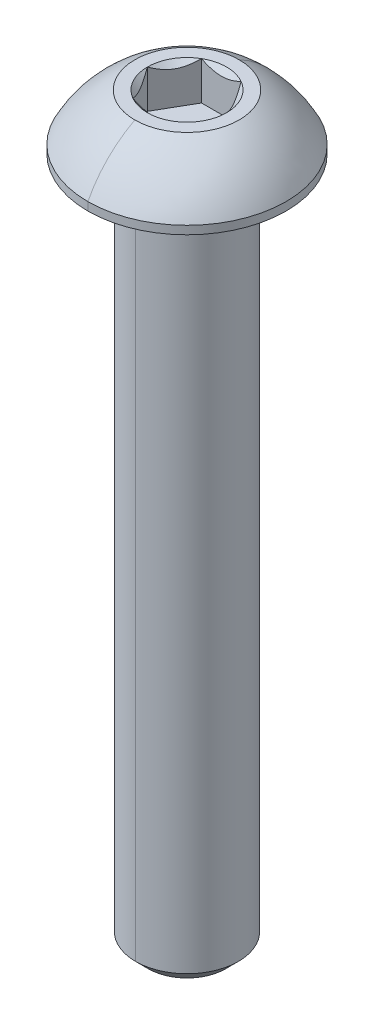
ISO-10303-21;
HEADER;
FILE_DESCRIPTION(('STEP AP214'),'2;1');
FILE_NAME('part.step','',(''),(''),'','','');
FILE_SCHEMA(('AUTOMOTIVE_DESIGN { 1 0 10303 214 1 1 1 1 }'));
ENDSEC;
DATA;
#1=APPLICATION_CONTEXT('core data for automotive mechanical design processes');
#2=APPLICATION_PROTOCOL_DEFINITION('international standard','automotive_design',2000,#1);
#3=PRODUCT_CONTEXT('',#1,'mechanical');
#4=PRODUCT('Part','Part','',(#3));
#5=PRODUCT_RELATED_PRODUCT_CATEGORY('part','',(#4));
#6=PRODUCT_DEFINITION_FORMATION('','',#4);
#7=PRODUCT_DEFINITION_CONTEXT('part definition',#1,'design');
#8=PRODUCT_DEFINITION('design','',#6,#7);
#9=PRODUCT_DEFINITION_SHAPE('','',#8);
#10=(LENGTH_UNIT() NAMED_UNIT(*) SI_UNIT(.MILLI.,.METRE.));
#11=(NAMED_UNIT(*) PLANE_ANGLE_UNIT() SI_UNIT($,.RADIAN.));
#12=(NAMED_UNIT(*) SI_UNIT($,.STERADIAN.) SOLID_ANGLE_UNIT());
#13=UNCERTAINTY_MEASURE_WITH_UNIT(LENGTH_MEASURE(1.E-05),#10,'distance_accuracy_value','');
#14=(GEOMETRIC_REPRESENTATION_CONTEXT(3) GLOBAL_UNCERTAINTY_ASSIGNED_CONTEXT((#13)) GLOBAL_UNIT_ASSIGNED_CONTEXT((#10,
#11,#12)) REPRESENTATION_CONTEXT('',''));
#15=CARTESIAN_POINT('',(0.,0.,0.));
#16=DIRECTION('',(0.,0.,1.));
#17=DIRECTION('',(1.,0.,0.));
#18=AXIS2_PLACEMENT_3D('',#15,#16,#17);
#19=CARTESIAN_POINT('',(0.,-0.152399999999997,0.));
#20=DIRECTION('',(0.,1.,0.));
#21=DIRECTION('',(0.,0.,1.));
#22=AXIS2_PLACEMENT_3D('',#19,#20,#21);
#23=TOROIDAL_SURFACE('',#22,2.5273,0.1524);
#24=CARTESIAN_POINT('',(0.,-0.152399999999997,-2.5273));
#25=DIRECTION('',(1.,0.,0.));
#26=DIRECTION('',(0.,0.,-1.));
#27=AXIS2_PLACEMENT_3D('',#24,#25,#26);
#28=CIRCLE('',#27,0.1524);
#29=CARTESIAN_POINT('',(0.,0.,-2.5273));
#30=VERTEX_POINT('',#29);
#31=CARTESIAN_POINT('',(0.,-0.152399999999997,-2.3749));
#32=VERTEX_POINT('',#31);
#33=EDGE_CURVE('E201',#30,#32,#28,.T.);
#34=ORIENTED_EDGE('',*,*,#33,.F.);
#35=CARTESIAN_POINT('',(0.,0.,0.));
#36=DIRECTION('',(0.,1.,0.));
#37=DIRECTION('',(0.,0.,1.));
#38=AXIS2_PLACEMENT_3D('',#35,#36,#37);
#39=CIRCLE('',#38,2.5273);
#40=CARTESIAN_POINT('',(0.,0.,2.5273));
#41=VERTEX_POINT('',#40);
#42=EDGE_CURVE('E188',#41,#30,#39,.T.);
#43=ORIENTED_EDGE('',*,*,#42,.F.);
#44=CARTESIAN_POINT('',(0.,-0.152399999999997,2.5273));
#45=DIRECTION('',(-1.,0.,0.));
#46=DIRECTION('',(0.,0.,1.));
#47=AXIS2_PLACEMENT_3D('',#44,#45,#46);
#48=CIRCLE('',#47,0.1524);
#49=CARTESIAN_POINT('',(0.,-0.152399999999997,2.3749));
#50=VERTEX_POINT('',#49);
#51=EDGE_CURVE('E211',#41,#50,#48,.T.);
#52=ORIENTED_EDGE('',*,*,#51,.T.);
#53=CARTESIAN_POINT('',(0.,-0.152399999999997,0.));
#54=DIRECTION('',(0.,-1.,0.));
#55=DIRECTION('',(0.,0.,1.));
#56=AXIS2_PLACEMENT_3D('',#53,#54,#55);
#57=CIRCLE('',#56,2.3749);
#58=EDGE_CURVE('E203',#32,#50,#57,.T.);
#59=ORIENTED_EDGE('',*,*,#58,.F.);
#60=EDGE_LOOP('',(#34,#43,#52,#59));
#61=FACE_BOUND('',#60,.T.);
#62=ADVANCED_FACE('F16',(#61),#23,.F.);
#63=CARTESIAN_POINT('',(0.,2.5654,0.));
#64=DIRECTION('',(0.,1.,0.));
#65=DIRECTION('',(0.,0.,1.));
#66=AXIS2_PLACEMENT_3D('',#63,#64,#65);
#67=CONICAL_SURFACE('',#66,1.83308710467706,0.78539816339745);
#68=DIRECTION('',(0.,0.707106781186546,-0.707106781186549));
#69=VECTOR('',#68,1.);
#70=CARTESIAN_POINT('',(0.,2.5654,-1.83308710467706));
#71=LINE('',#70,#69);
#72=CARTESIAN_POINT('',(0.,0.732312895322944,0.));
#73=VERTEX_POINT('',#72);
#74=CARTESIAN_POINT('',(0.,0.7874,-0.0550871046770556));
#75=VERTEX_POINT('',#74);
#76=EDGE_CURVE('E179',#73,#75,#71,.T.);
#77=ORIENTED_EDGE('',*,*,#76,.F.);
#78=DIRECTION('',(0.,0.707106781186546,0.707106781186549));
#79=VECTOR('',#78,1.);
#80=CARTESIAN_POINT('',(0.,2.5654,1.83308710467706));
#81=LINE('',#80,#79);
#82=CARTESIAN_POINT('',(0.,0.7874,0.0550871046770556));
#83=VERTEX_POINT('',#82);
#84=EDGE_CURVE('E228',#73,#83,#81,.T.);
#85=ORIENTED_EDGE('',*,*,#84,.T.);
#86=CARTESIAN_POINT('',(0.,0.7874,0.));
#87=DIRECTION('',(0.,1.,0.));
#88=DIRECTION('',(0.,0.,1.));
#89=AXIS2_PLACEMENT_3D('',#86,#87,#88);
#90=CIRCLE('',#89,0.0550871046770558);
#91=EDGE_CURVE('E169',#83,#75,#90,.T.);
#92=ORIENTED_EDGE('',*,*,#91,.T.);
#93=EDGE_LOOP('',(#77,#85,#92));
#94=FACE_BOUND('',#93,.T.);
#95=ADVANCED_FACE('F321',(#94),#67,.F.);
#96=CARTESIAN_POINT('',(1.83308710467706,0.7874,0.));
#97=DIRECTION('',(0.866025403784439,0.,-0.5));
#98=DIRECTION('',(0.,-1.,0.));
#99=AXIS2_PLACEMENT_3D('',#96,#97,#98);
#100=PLANE('',#99);
#101=DIRECTION('',(0.,1.,0.));
#102=VECTOR('',#101,1.);
#103=CARTESIAN_POINT('',(1.83308710467706,0.7874,0.));
#104=LINE('',#103,#102);
#105=CARTESIAN_POINT('',(1.83308710467706,0.7874,0.));
#106=VERTEX_POINT('',#105);
#107=CARTESIAN_POINT('',(1.83308710467706,2.5654,0.));
#108=VERTEX_POINT('',#107);
#109=EDGE_CURVE('E11',#106,#108,#104,.T.);
#110=ORIENTED_EDGE('',*,*,#109,.T.);
#111=CARTESIAN_POINT('',(1.83308710467706,2.5654,0.));
#112=CARTESIAN_POINT('',(1.58854939316106,2.32086228848399,-0.423551740712339));
#113=CARTESIAN_POINT('',(1.37650342717985,2.31981648546325,-0.790826127331817));
#114=CARTESIAN_POINT('',(1.16317917435944,2.31876437797812,-1.16031457170343));
#115=CARTESIAN_POINT('',(0.91654355233853,2.5654,-1.5875));
#116=B_SPLINE_CURVE_WITH_KNOTS('',2,(#111,#112,#113,#114,#115),.UNSPECIFIED.,.F.,.F.,(3,2,3),
(0.,0.5,1.),.UNSPECIFIED.);
#117=CARTESIAN_POINT('',(0.916543552338531,2.5654,-1.5875));
#118=VERTEX_POINT('',#117);
#119=EDGE_CURVE('E303',#108,#118,#116,.T.);
#120=ORIENTED_EDGE('',*,*,#119,.T.);
#121=DIRECTION('',(0.,1.,0.));
#122=VECTOR('',#121,1.);
#123=CARTESIAN_POINT('',(0.916543552338531,0.7874,-1.5875));
#124=LINE('',#123,#122);
#125=CARTESIAN_POINT('',(0.916543552338531,0.7874,-1.5875));
#126=VERTEX_POINT('',#125);
#127=EDGE_CURVE('E491',#126,#118,#124,.T.);
#128=ORIENTED_EDGE('',*,*,#127,.F.);
#129=DIRECTION('',(-0.5,0.,-0.866025403784439));
#130=VECTOR('',#129,1.);
#131=CARTESIAN_POINT('',(1.83308710467706,0.7874,0.));
#132=LINE('',#131,#130);
#133=EDGE_CURVE('E234',#106,#126,#132,.T.);
#134=ORIENTED_EDGE('',*,*,#133,.F.);
#135=EDGE_LOOP('',(#110,#120,#128,#134));
#136=FACE_BOUND('',#135,.T.);
#137=ADVANCED_FACE('F310',(#136),#100,.F.);
#138=CARTESIAN_POINT('',(0.916543552338531,0.7874,1.5875));
#139=DIRECTION('',(0.866025403784439,0.,0.5));
#140=DIRECTION('',(0.,-1.,0.));
#141=AXIS2_PLACEMENT_3D('',#138,#139,#140);
#142=PLANE('',#141);
#143=DIRECTION('',(0.,1.,0.));
#144=VECTOR('',#143,1.);
#145=CARTESIAN_POINT('',(0.916543552338531,0.7874,1.5875));
#146=LINE('',#145,#144);
#147=CARTESIAN_POINT('',(0.916543552338531,0.7874,1.5875));
#148=VERTEX_POINT('',#147);
#149=CARTESIAN_POINT('',(0.916543552338531,2.5654,1.5875));
#150=VERTEX_POINT('',#149);
#151=EDGE_CURVE('E29',#148,#150,#146,.T.);
#152=ORIENTED_EDGE('',*,*,#151,.T.);
#153=CARTESIAN_POINT('',(0.916543552338531,2.5654,1.5875));
#154=CARTESIAN_POINT('',(1.16108126385472,2.32086228848382,1.16394825928734));
#155=CARTESIAN_POINT('',(1.37312722983574,2.31981648546325,0.796673872668184));
#156=CARTESIAN_POINT('',(1.58645148265633,2.3187643779783,0.427185428296259));
#157=CARTESIAN_POINT('',(1.83308710467706,2.5654,0.));
#158=B_SPLINE_CURVE_WITH_KNOTS('',2,(#153,#154,#155,#156,#157),.UNSPECIFIED.,.F.,.F.,(3,2,3),
(0.,0.5,1.),.UNSPECIFIED.);
#159=EDGE_CURVE('E584',#150,#108,#158,.T.);
#160=ORIENTED_EDGE('',*,*,#159,.T.);
#161=ORIENTED_EDGE('',*,*,#109,.F.);
#162=DIRECTION('',(0.5,0.,-0.866025403784439));
#163=VECTOR('',#162,1.);
#164=CARTESIAN_POINT('',(0.916543552338531,0.7874,1.5875));
#165=LINE('',#164,#163);
#166=EDGE_CURVE('E273',#148,#106,#165,.T.);
#167=ORIENTED_EDGE('',*,*,#166,.F.);
#168=EDGE_LOOP('',(#152,#160,#161,#167));
#169=FACE_BOUND('',#168,.T.);
#170=ADVANCED_FACE('F320',(#169),#142,.F.);
#171=CARTESIAN_POINT('',(-0.91654355233853,0.7874,1.5875));
#172=DIRECTION('',(0.,0.,1.));
#173=DIRECTION('',(1.,0.,0.));
#174=AXIS2_PLACEMENT_3D('',#171,#172,#173);
#175=PLANE('',#174);
#176=DIRECTION('',(0.,1.,0.));
#177=VECTOR('',#176,1.);
#178=CARTESIAN_POINT('',(-0.91654355233853,0.7874,1.5875));
#179=LINE('',#178,#177);
#180=CARTESIAN_POINT('',(-0.91654355233853,0.7874,1.5875));
#181=VERTEX_POINT('',#180);
#182=CARTESIAN_POINT('',(-0.91654355233853,2.5654,1.5875));
#183=VERTEX_POINT('',#182);
#184=EDGE_CURVE('E578',#181,#183,#179,.T.);
#185=ORIENTED_EDGE('',*,*,#184,.T.);
#186=CARTESIAN_POINT('',(-0.916543552338531,2.5654,1.5875));
#187=CARTESIAN_POINT('',(-0.684381010738564,2.44931872920002,1.5875));
#188=CARTESIAN_POINT('',(-0.4718738638875,2.38845938444161,1.5875));
#189=CARTESIAN_POINT('',(-0.232175759974894,2.31981289532294,1.5875));
#190=CARTESIAN_POINT('',(0.,2.31981289532294,1.5875));
#191=B_SPLINE_CURVE_WITH_KNOTS('',2,(#186,#187,#188,#189,#190),.UNSPECIFIED.,.F.,.F.,(3,2,3),
(0.,0.5,1.),.UNSPECIFIED.);
#192=CARTESIAN_POINT('',(0.,2.31981289532294,1.5875));
#193=VERTEX_POINT('',#192);
#194=EDGE_CURVE('E582',#183,#193,#191,.T.);
#195=ORIENTED_EDGE('',*,*,#194,.T.);
#196=CARTESIAN_POINT('',(0.,2.31981289532294,1.5875));
#197=CARTESIAN_POINT('',(0.229732695645398,2.31981289532294,1.5875));
#198=CARTESIAN_POINT('',(0.471961624215038,2.3884843914945,1.5875));
#199=CARTESIAN_POINT('',(0.68154594324368,2.44790119545257,1.5875));
#200=CARTESIAN_POINT('',(0.91654355233853,2.5654,1.5875));
#201=B_SPLINE_CURVE_WITH_KNOTS('',2,(#196,#197,#198,#199,#200),.UNSPECIFIED.,.F.,.F.,(3,2,3),
(0.,0.5,1.),.UNSPECIFIED.);
#202=EDGE_CURVE('E298',#193,#150,#201,.T.);
#203=ORIENTED_EDGE('',*,*,#202,.T.);
#204=ORIENTED_EDGE('',*,*,#151,.F.);
#205=DIRECTION('',(1.,0.,0.));
#206=VECTOR('',#205,1.);
#207=CARTESIAN_POINT('',(-0.91654355233853,0.7874,1.5875));
#208=LINE('',#207,#206);
#209=EDGE_CURVE('E277',#181,#148,#208,.T.);
#210=ORIENTED_EDGE('',*,*,#209,.F.);
#211=EDGE_LOOP('',(#185,#195,#203,#204,#210));
#212=FACE_BOUND('',#211,.T.);
#213=ADVANCED_FACE('F346',(#212),#175,.F.);
#214=CARTESIAN_POINT('',(-1.83308710467706,0.7874,0.));
#215=DIRECTION('',(-0.866025403784439,0.,0.5));
#216=DIRECTION('',(0.,1.,0.));
#217=AXIS2_PLACEMENT_3D('',#214,#215,#216);
#218=PLANE('',#217);
#219=DIRECTION('',(0.,1.,0.));
#220=VECTOR('',#219,1.);
#221=CARTESIAN_POINT('',(-1.83308710467706,0.7874,0.));
#222=LINE('',#221,#220);
#223=CARTESIAN_POINT('',(-1.83308710467706,0.7874,0.));
#224=VERTEX_POINT('',#223);
#225=CARTESIAN_POINT('',(-1.83308710467706,2.5654,0.));
#226=VERTEX_POINT('',#225);
#227=EDGE_CURVE('E412',#224,#226,#222,.T.);
#228=ORIENTED_EDGE('',*,*,#227,.T.);
#229=CARTESIAN_POINT('',(-1.83308710467706,2.5654,0.));
#230=CARTESIAN_POINT('',(-1.58854939316106,2.32086228848399,0.423551740712331));
#231=CARTESIAN_POINT('',(-1.37650342717985,2.31981648546325,0.790826127331817));
#232=CARTESIAN_POINT('',(-1.16317917435944,2.31876437797812,1.16031457170343));
#233=CARTESIAN_POINT('',(-0.91654355233853,2.5654,1.5875));
#234=B_SPLINE_CURVE_WITH_KNOTS('',2,(#229,#230,#231,#232,#233),.UNSPECIFIED.,.F.,.F.,(3,2,3),
(0.,0.5,1.),.UNSPECIFIED.);
#235=EDGE_CURVE('E395',#226,#183,#234,.T.);
#236=ORIENTED_EDGE('',*,*,#235,.T.);
#237=ORIENTED_EDGE('',*,*,#184,.F.);
#238=DIRECTION('',(0.5,0.,0.866025403784438));
#239=VECTOR('',#238,1.);
#240=CARTESIAN_POINT('',(-1.83308710467706,0.7874,0.));
#241=LINE('',#240,#239);
#242=EDGE_CURVE('E272',#224,#181,#241,.T.);
#243=ORIENTED_EDGE('',*,*,#242,.F.);
#244=EDGE_LOOP('',(#228,#236,#237,#243));
#245=FACE_BOUND('',#244,.T.);
#246=ADVANCED_FACE('F350',(#245),#218,.F.);
#247=CARTESIAN_POINT('',(-0.916543552338531,0.7874,-1.5875));
#248=DIRECTION('',(-0.866025403784439,0.,-0.5));
#249=DIRECTION('',(-0.5,0.,0.866025403784439));
#250=AXIS2_PLACEMENT_3D('',#247,#248,#249);
#251=PLANE('',#250);
#252=DIRECTION('',(0.,1.,0.));
#253=VECTOR('',#252,1.);
#254=CARTESIAN_POINT('',(-0.916543552338531,0.7874,-1.5875));
#255=LINE('',#254,#253);
#256=CARTESIAN_POINT('',(-0.916543552338531,0.7874,-1.5875));
#257=VERTEX_POINT('',#256);
#258=CARTESIAN_POINT('',(-0.916543552338531,2.5654,-1.5875));
#259=VERTEX_POINT('',#258);
#260=EDGE_CURVE('E549',#257,#259,#255,.T.);
#261=ORIENTED_EDGE('',*,*,#260,.T.);
#262=CARTESIAN_POINT('',(-0.916543552338531,2.5654,-1.5875));
#263=CARTESIAN_POINT('',(-1.16108126385453,2.320862288484,-1.16394825928767));
#264=CARTESIAN_POINT('',(-1.37312722983574,2.31981648546325,-0.796673872668183));
#265=CARTESIAN_POINT('',(-1.58645148265615,2.31876437797813,-0.427185428296571));
#266=CARTESIAN_POINT('',(-1.83308710467706,2.5654,0.));
#267=B_SPLINE_CURVE_WITH_KNOTS('',2,(#262,#263,#264,#265,#266),.UNSPECIFIED.,.F.,.F.,(3,2,3),
(0.,0.5,1.),.UNSPECIFIED.);
#268=EDGE_CURVE('E545',#259,#226,#267,.T.);
#269=ORIENTED_EDGE('',*,*,#268,.T.);
#270=ORIENTED_EDGE('',*,*,#227,.F.);
#271=DIRECTION('',(-0.5,0.,0.866025403784439));
#272=VECTOR('',#271,1.);
#273=CARTESIAN_POINT('',(-0.916543552338531,0.7874,-1.5875));
#274=LINE('',#273,#272);
#275=EDGE_CURVE('E233',#257,#224,#274,.T.);
#276=ORIENTED_EDGE('',*,*,#275,.F.);
#277=EDGE_LOOP('',(#261,#269,#270,#276));
#278=FACE_BOUND('',#277,.T.);
#279=ADVANCED_FACE('F436',(#278),#251,.F.);
#280=CARTESIAN_POINT('',(0.916543552338531,0.7874,-1.5875));
#281=DIRECTION('',(0.,0.,-1.));
#282=DIRECTION('',(-1.,0.,0.));
#283=AXIS2_PLACEMENT_3D('',#280,#281,#282);
#284=PLANE('',#283);
#285=ORIENTED_EDGE('',*,*,#127,.T.);
#286=CARTESIAN_POINT('',(0.916543552338531,2.5654,-1.5875));
#287=CARTESIAN_POINT('',(0.68330023814449,2.44877834290298,-1.5875));
#288=CARTESIAN_POINT('',(0.472022049766507,2.38850161206546,-1.5875));
#289=CARTESIAN_POINT('',(0.231606862063275,2.31991222444484,-1.5875));
#290=CARTESIAN_POINT('',(0.000126990617285933,2.31981290040219,-1.5875));
#291=CARTESIAN_POINT('',(-0.230319895797069,2.3197140195957,-1.5875));
#292=CARTESIAN_POINT('',(-0.471813597713689,2.38844221424328,-1.5875));
#293=CARTESIAN_POINT('',(-0.682613944360854,2.44843519601116,-1.5875));
#294=CARTESIAN_POINT('',(-0.916543552338529,2.5654,-1.5875));
#295=B_SPLINE_CURVE_WITH_KNOTS('',2,(#286,#287,#288,#289,#290,#291,#292,#293,#294),
.UNSPECIFIED.,.F.,.F.,(3,2,2,2,3),(0.,0.25,0.5,0.75,1.),.UNSPECIFIED.);
#296=EDGE_CURVE('E453',#118,#259,#295,.T.);
#297=ORIENTED_EDGE('',*,*,#296,.T.);
#298=ORIENTED_EDGE('',*,*,#260,.F.);
#299=DIRECTION('',(-1.,0.,0.));
#300=VECTOR('',#299,1.);
#301=CARTESIAN_POINT('',(0.916543552338531,0.7874,-1.5875));
#302=LINE('',#301,#300);
#303=EDGE_CURVE('E229',#126,#257,#302,.T.);
#304=ORIENTED_EDGE('',*,*,#303,.F.);
#305=EDGE_LOOP('',(#285,#297,#298,#304));
#306=FACE_BOUND('',#305,.T.);
#307=ADVANCED_FACE('F431',(#306),#284,.F.);
#308=CARTESIAN_POINT('',(0.,0.7874,0.));
#309=DIRECTION('',(0.,1.,0.));
#310=DIRECTION('',(1.,0.,0.));
#311=AXIS2_PLACEMENT_3D('',#308,#309,#310);
#312=PLANE('',#311);
#313=ORIENTED_EDGE('',*,*,#91,.F.);
#314=CARTESIAN_POINT('',(0.,0.7874,0.));
#315=DIRECTION('',(0.,1.,0.));
#316=DIRECTION('',(0.,0.,1.));
#317=AXIS2_PLACEMENT_3D('',#314,#315,#316);
#318=CIRCLE('',#317,0.0550871046770558);
#319=EDGE_CURVE('E227',#75,#83,#318,.T.);
#320=ORIENTED_EDGE('',*,*,#319,.F.);
#321=EDGE_LOOP('',(#313,#320));
#322=FACE_BOUND('',#321,.T.);
#323=ORIENTED_EDGE('',*,*,#133,.T.);
#324=ORIENTED_EDGE('',*,*,#303,.T.);
#325=ORIENTED_EDGE('',*,*,#275,.T.);
#326=ORIENTED_EDGE('',*,*,#242,.T.);
#327=ORIENTED_EDGE('',*,*,#209,.T.);
#328=ORIENTED_EDGE('',*,*,#166,.T.);
#329=EDGE_LOOP('',(#323,#324,#325,#326,#327,#328));
#330=FACE_BOUND('',#329,.T.);
#331=ADVANCED_FACE('F435',(#322,#330),#312,.T.);
#332=CARTESIAN_POINT('',(0.,2.5654,0.));
#333=DIRECTION('',(0.,1.,0.));
#334=DIRECTION('',(0.,0.,1.));
#335=AXIS2_PLACEMENT_3D('',#332,#333,#334);
#336=CONICAL_SURFACE('',#335,1.83308710467706,0.78539816339745);
#337=CARTESIAN_POINT('',(0.,2.5654,0.));
#338=DIRECTION('',(0.,1.,0.));
#339=DIRECTION('',(0.,0.,1.));
#340=AXIS2_PLACEMENT_3D('',#337,#338,#339);
#341=CIRCLE('',#340,1.83308710467706);
#342=EDGE_CURVE('E839',#108,#118,#341,.T.);
#343=ORIENTED_EDGE('',*,*,#342,.T.);
#344=ORIENTED_EDGE('',*,*,#119,.F.);
#345=EDGE_LOOP('',(#343,#344));
#346=FACE_BOUND('',#345,.T.);
#347=ADVANCED_FACE('F426',(#346),#336,.F.);
#348=CARTESIAN_POINT('',(0.,2.5654,0.));
#349=DIRECTION('',(0.,1.,0.));
#350=DIRECTION('',(0.,0.,1.));
#351=AXIS2_PLACEMENT_3D('',#348,#349,#350);
#352=CONICAL_SURFACE('',#351,1.83308710467706,0.78539816339745);
#353=CARTESIAN_POINT('',(0.,2.5654,0.));
#354=DIRECTION('',(0.,1.,0.));
#355=DIRECTION('',(0.,0.,1.));
#356=AXIS2_PLACEMENT_3D('',#353,#354,#355);
#357=CIRCLE('',#356,1.83308710467706);
#358=EDGE_CURVE('E833',#150,#108,#357,.T.);
#359=ORIENTED_EDGE('',*,*,#358,.T.);
#360=ORIENTED_EDGE('',*,*,#159,.F.);
#361=EDGE_LOOP('',(#359,#360));
#362=FACE_BOUND('',#361,.T.);
#363=ADVANCED_FACE('F560',(#362),#352,.F.);
#364=CARTESIAN_POINT('',(0.,2.5654,0.));
#365=DIRECTION('',(0.,1.,0.));
#366=DIRECTION('',(0.,0.,1.));
#367=AXIS2_PLACEMENT_3D('',#364,#365,#366);
#368=CONICAL_SURFACE('',#367,1.83308710467706,0.78539816339745);
#369=DIRECTION('',(0.,0.707106781186546,0.707106781186549));
#370=VECTOR('',#369,1.);
#371=CARTESIAN_POINT('',(0.,2.5654,1.83308710467706));
#372=LINE('',#371,#370);
#373=CARTESIAN_POINT('',(0.,2.5654,1.83308710467706));
#374=VERTEX_POINT('',#373);
#375=EDGE_CURVE('E373',#193,#374,#372,.T.);
#376=ORIENTED_EDGE('',*,*,#375,.F.);
#377=ORIENTED_EDGE('',*,*,#194,.F.);
#378=CARTESIAN_POINT('',(0.,2.5654,0.));
#379=DIRECTION('',(0.,1.,0.));
#380=DIRECTION('',(0.,0.,1.));
#381=AXIS2_PLACEMENT_3D('',#378,#379,#380);
#382=CIRCLE('',#381,1.83308710467706);
#383=EDGE_CURVE('E79',#183,#374,#382,.T.);
#384=ORIENTED_EDGE('',*,*,#383,.T.);
#385=EDGE_LOOP('',(#376,#377,#384));
#386=FACE_BOUND('',#385,.T.);
#387=ADVANCED_FACE('F425',(#386),#368,.F.);
#388=CARTESIAN_POINT('',(0.,2.5654,0.));
#389=DIRECTION('',(0.,1.,0.));
#390=DIRECTION('',(0.,0.,1.));
#391=AXIS2_PLACEMENT_3D('',#388,#389,#390);
#392=CONICAL_SURFACE('',#391,1.83308710467706,0.78539816339745);
#393=CARTESIAN_POINT('',(0.,2.5654,0.));
#394=DIRECTION('',(0.,1.,0.));
#395=DIRECTION('',(0.,0.,1.));
#396=AXIS2_PLACEMENT_3D('',#393,#394,#395);
#397=CIRCLE('',#396,1.83308710467706);
#398=EDGE_CURVE('E821',#226,#183,#397,.T.);
#399=ORIENTED_EDGE('',*,*,#398,.T.);
#400=ORIENTED_EDGE('',*,*,#235,.F.);
#401=EDGE_LOOP('',(#399,#400));
#402=FACE_BOUND('',#401,.T.);
#403=ADVANCED_FACE('F414',(#402),#392,.F.);
#404=CARTESIAN_POINT('',(0.,2.5654,0.));
#405=DIRECTION('',(0.,1.,0.));
#406=DIRECTION('',(0.,0.,1.));
#407=AXIS2_PLACEMENT_3D('',#404,#405,#406);
#408=CONICAL_SURFACE('',#407,1.83308710467706,0.78539816339745);
#409=CARTESIAN_POINT('',(0.,2.5654,0.));
#410=DIRECTION('',(0.,1.,0.));
#411=DIRECTION('',(0.,0.,1.));
#412=AXIS2_PLACEMENT_3D('',#409,#410,#411);
#413=CIRCLE('',#412,1.83308710467706);
#414=EDGE_CURVE('E814',#259,#226,#413,.T.);
#415=ORIENTED_EDGE('',*,*,#414,.T.);
#416=ORIENTED_EDGE('',*,*,#268,.F.);
#417=EDGE_LOOP('',(#415,#416));
#418=FACE_BOUND('',#417,.T.);
#419=ADVANCED_FACE('F424',(#418),#408,.F.);
#420=CARTESIAN_POINT('',(0.,2.5654,0.));
#421=DIRECTION('',(0.,1.,0.));
#422=DIRECTION('',(0.,0.,1.));
#423=AXIS2_PLACEMENT_3D('',#420,#421,#422);
#424=CONICAL_SURFACE('',#423,1.83308710467706,0.78539816339745);
#425=CARTESIAN_POINT('',(0.,2.5654,0.));
#426=DIRECTION('',(0.,1.,0.));
#427=DIRECTION('',(0.,0.,1.));
#428=AXIS2_PLACEMENT_3D('',#425,#426,#427);
#429=CIRCLE('',#428,1.83308710467706);
#430=EDGE_CURVE('E253',#118,#259,#429,.T.);
#431=ORIENTED_EDGE('',*,*,#430,.T.);
#432=ORIENTED_EDGE('',*,*,#296,.F.);
#433=EDGE_LOOP('',(#431,#432));
#434=FACE_BOUND('',#433,.T.);
#435=ADVANCED_FACE('F458',(#434),#424,.F.);
#436=CARTESIAN_POINT('',(0.,2.5654,-2.413));
#437=DIRECTION('',(0.,-1.,0.));
#438=DIRECTION('',(0.,0.,-1.));
#439=AXIS2_PLACEMENT_3D('',#436,#437,#438);
#440=PLANE('',#439);
#441=ORIENTED_EDGE('',*,*,#430,.F.);
#442=ORIENTED_EDGE('',*,*,#342,.F.);
#443=ORIENTED_EDGE('',*,*,#358,.F.);
#444=CARTESIAN_POINT('',(0.,2.5654,0.));
#445=DIRECTION('',(0.,1.,0.));
#446=DIRECTION('',(0.,0.,1.));
#447=AXIS2_PLACEMENT_3D('',#444,#445,#446);
#448=CIRCLE('',#447,1.83308710467706);
#449=EDGE_CURVE('E374',#374,#150,#448,.T.);
#450=ORIENTED_EDGE('',*,*,#449,.F.);
#451=ORIENTED_EDGE('',*,*,#383,.F.);
#452=ORIENTED_EDGE('',*,*,#398,.F.);
#453=ORIENTED_EDGE('',*,*,#414,.F.);
#454=EDGE_LOOP('',(#441,#442,#443,#450,#451,#452,#453));
#455=FACE_BOUND('',#454,.T.);
#456=CARTESIAN_POINT('',(0.,2.5654,0.));
#457=DIRECTION('',(0.,1.,0.));
#458=DIRECTION('',(0.,0.,1.));
#459=AXIS2_PLACEMENT_3D('',#456,#457,#458);
#460=CIRCLE('',#459,2.413);
#461=CARTESIAN_POINT('',(0.,2.5654,2.413));
#462=VERTEX_POINT('',#461);
#463=CARTESIAN_POINT('',(0.,2.5654,-2.413));
#464=VERTEX_POINT('',#463);
#465=EDGE_CURVE('E248',#462,#464,#460,.T.);
#466=ORIENTED_EDGE('',*,*,#465,.T.);
#467=CARTESIAN_POINT('',(0.,2.5654,0.));
#468=DIRECTION('',(0.,1.,0.));
#469=DIRECTION('',(0.,0.,1.));
#470=AXIS2_PLACEMENT_3D('',#467,#468,#469);
#471=CIRCLE('',#470,2.413);
#472=EDGE_CURVE('E250',#464,#462,#471,.T.);
#473=ORIENTED_EDGE('',*,*,#472,.T.);
#474=EDGE_LOOP('',(#466,#473));
#475=FACE_BOUND('',#474,.T.);
#476=ADVANCED_FACE('F322',(#455,#475),#440,.F.);
#477=CARTESIAN_POINT('',(0.,-1.9398474797777,0.));
#478=DIRECTION('',(0.,1.,0.));
#479=DIRECTION('',(0.,0.,1.));
#480=AXIS2_PLACEMENT_3D('',#477,#478,#479);
#481=DEGENERATE_TOROIDAL_SURFACE('',#480,0.065843178235288,5.08,.T.);
#482=CARTESIAN_POINT('',(0.,-1.9398474797777,-0.065843178235288));
#483=DIRECTION('',(1.,0.,0.));
#484=DIRECTION('',(0.,0.,-1.));
#485=AXIS2_PLACEMENT_3D('',#482,#483,#484);
#486=CIRCLE('',#485,5.08);
#487=CARTESIAN_POINT('',(0.,0.381,-4.5847));
#488=VERTEX_POINT('',#487);
#489=EDGE_CURVE('E257',#488,#464,#486,.T.);
#490=ORIENTED_EDGE('',*,*,#489,.F.);
#491=CARTESIAN_POINT('',(0.,0.381,0.));
#492=DIRECTION('',(0.,1.,0.));
#493=DIRECTION('',(0.,0.,1.));
#494=AXIS2_PLACEMENT_3D('',#491,#492,#493);
#495=CIRCLE('',#494,4.5847);
#496=CARTESIAN_POINT('',(0.,0.381,4.5847));
#497=VERTEX_POINT('',#496);
#498=EDGE_CURVE('E62',#488,#497,#495,.T.);
#499=ORIENTED_EDGE('',*,*,#498,.T.);
#500=CARTESIAN_POINT('',(0.,-1.9398474797777,0.065843178235288));
#501=DIRECTION('',(-1.,0.,0.));
#502=DIRECTION('',(0.,0.,1.));
#503=AXIS2_PLACEMENT_3D('',#500,#501,#502);
#504=CIRCLE('',#503,5.08);
#505=EDGE_CURVE('E245',#497,#462,#504,.T.);
#506=ORIENTED_EDGE('',*,*,#505,.T.);
#507=ORIENTED_EDGE('',*,*,#472,.F.);
#508=EDGE_LOOP('',(#490,#499,#506,#507));
#509=FACE_BOUND('',#508,.T.);
#510=ADVANCED_FACE('F467',(#509),#481,.T.);
#511=CARTESIAN_POINT('',(0.,2.5654,0.));
#512=DIRECTION('',(0.,1.,0.));
#513=DIRECTION('',(0.,0.,1.));
#514=AXIS2_PLACEMENT_3D('',#511,#512,#513);
#515=CYLINDRICAL_SURFACE('',#514,4.5847);
#516=DIRECTION('',(0.,1.,0.));
#517=VECTOR('',#516,1.);
#518=CARTESIAN_POINT('',(0.,2.5654,-4.5847));
#519=LINE('',#518,#517);
#520=CARTESIAN_POINT('',(0.,0.,-4.5847));
#521=VERTEX_POINT('',#520);
#522=EDGE_CURVE('E261',#521,#488,#519,.T.);
#523=ORIENTED_EDGE('',*,*,#522,.F.);
#524=CARTESIAN_POINT('',(0.,0.,0.));
#525=DIRECTION('',(0.,1.,0.));
#526=DIRECTION('',(0.,0.,1.));
#527=AXIS2_PLACEMENT_3D('',#524,#525,#526);
#528=CIRCLE('',#527,4.5847);
#529=CARTESIAN_POINT('',(0.,0.,4.5847));
#530=VERTEX_POINT('',#529);
#531=EDGE_CURVE('E198',#521,#530,#528,.T.);
#532=ORIENTED_EDGE('',*,*,#531,.T.);
#533=DIRECTION('',(0.,1.,0.));
#534=VECTOR('',#533,1.);
#535=CARTESIAN_POINT('',(0.,2.5654,4.5847));
#536=LINE('',#535,#534);
#537=EDGE_CURVE('E224',#530,#497,#536,.T.);
#538=ORIENTED_EDGE('',*,*,#537,.T.);
#539=ORIENTED_EDGE('',*,*,#498,.F.);
#540=EDGE_LOOP('',(#523,#532,#538,#539));
#541=FACE_BOUND('',#540,.T.);
#542=ADVANCED_FACE('F338',(#541),#515,.T.);
#543=CARTESIAN_POINT('',(0.,0.,0.));
#544=DIRECTION('',(0.,1.,0.));
#545=DIRECTION('',(1.,0.,0.));
#546=AXIS2_PLACEMENT_3D('',#543,#544,#545);
#547=PLANE('',#546);
#548=ORIENTED_EDGE('',*,*,#42,.T.);
#549=CARTESIAN_POINT('',(0.,0.,0.));
#550=DIRECTION('',(0.,1.,0.));
#551=DIRECTION('',(0.,0.,1.));
#552=AXIS2_PLACEMENT_3D('',#549,#550,#551);
#553=CIRCLE('',#552,2.5273);
#554=EDGE_CURVE('E193',#30,#41,#553,.T.);
#555=ORIENTED_EDGE('',*,*,#554,.T.);
#556=EDGE_LOOP('',(#548,#555));
#557=FACE_BOUND('',#556,.T.);
#558=CARTESIAN_POINT('',(0.,0.,0.));
#559=DIRECTION('',(0.,1.,0.));
#560=DIRECTION('',(0.,0.,1.));
#561=AXIS2_PLACEMENT_3D('',#558,#559,#560);
#562=CIRCLE('',#561,4.5847);
#563=EDGE_CURVE('E247',#530,#521,#562,.T.);
#564=ORIENTED_EDGE('',*,*,#563,.F.);
#565=ORIENTED_EDGE('',*,*,#531,.F.);
#566=EDGE_LOOP('',(#564,#565));
#567=FACE_BOUND('',#566,.T.);
#568=ADVANCED_FACE('F190',(#557,#567),#547,.F.);
#569=CARTESIAN_POINT('',(0.,-31.1658,0.));
#570=DIRECTION('',(0.,1.,0.));
#571=DIRECTION('',(0.,0.,1.));
#572=AXIS2_PLACEMENT_3D('',#569,#570,#571);
#573=CONICAL_SURFACE('',#572,2.3749,0.785398163397441);
#574=DIRECTION('',(0.,0.707106781186553,-0.707106781186542));
#575=VECTOR('',#574,1.);
#576=CARTESIAN_POINT('',(0.,-31.1658,-2.3749));
#577=LINE('',#576,#575);
#578=CARTESIAN_POINT('',(0.,-31.75,-1.7907));
#579=VERTEX_POINT('',#578);
#580=CARTESIAN_POINT('',(0.,-31.1658,-2.3749));
#581=VERTEX_POINT('',#580);
#582=EDGE_CURVE('E223',#579,#581,#577,.T.);
#583=ORIENTED_EDGE('',*,*,#582,.F.);
#584=CARTESIAN_POINT('',(0.,-31.75,0.));
#585=DIRECTION('',(0.,-1.,0.));
#586=DIRECTION('',(0.,0.,1.));
#587=AXIS2_PLACEMENT_3D('',#584,#585,#586);
#588=CIRCLE('',#587,1.7907);
#589=CARTESIAN_POINT('',(0.,-31.75,1.7907));
#590=VERTEX_POINT('',#589);
#591=EDGE_CURVE('E235',#590,#579,#588,.T.);
#592=ORIENTED_EDGE('',*,*,#591,.F.);
#593=DIRECTION('',(0.,0.707106781186553,0.707106781186542));
#594=VECTOR('',#593,1.);
#595=CARTESIAN_POINT('',(0.,-31.1658,2.3749));
#596=LINE('',#595,#594);
#597=CARTESIAN_POINT('',(0.,-31.1658,2.3749));
#598=VERTEX_POINT('',#597);
#599=EDGE_CURVE('E239',#590,#598,#596,.T.);
#600=ORIENTED_EDGE('',*,*,#599,.T.);
#601=CARTESIAN_POINT('',(0.,-31.1658,0.));
#602=DIRECTION('',(0.,1.,0.));
#603=DIRECTION('',(0.,0.,1.));
#604=AXIS2_PLACEMENT_3D('',#601,#602,#603);
#605=CIRCLE('',#604,2.3749);
#606=EDGE_CURVE('E238',#581,#598,#605,.T.);
#607=ORIENTED_EDGE('',*,*,#606,.F.);
#608=EDGE_LOOP('',(#583,#592,#600,#607));
#609=FACE_BOUND('',#608,.T.);
#610=ADVANCED_FACE('F337',(#609),#573,.T.);
#611=CARTESIAN_POINT('',(0.,-31.75,0.));
#612=DIRECTION('',(0.,1.,0.));
#613=DIRECTION('',(1.,0.,0.));
#614=AXIS2_PLACEMENT_3D('',#611,#612,#613);
#615=PLANE('',#614);
#616=ORIENTED_EDGE('',*,*,#591,.T.);
#617=CARTESIAN_POINT('',(0.,-31.75,0.));
#618=DIRECTION('',(0.,-1.,0.));
#619=DIRECTION('',(0.,0.,1.));
#620=AXIS2_PLACEMENT_3D('',#617,#618,#619);
#621=CIRCLE('',#620,1.7907);
#622=EDGE_CURVE('E219',#579,#590,#621,.T.);
#623=ORIENTED_EDGE('',*,*,#622,.T.);
#624=EDGE_LOOP('',(#616,#623));
#625=FACE_BOUND('',#624,.T.);
#626=ADVANCED_FACE('F18',(#625),#615,.F.);
#627=CARTESIAN_POINT('',(0.,-31.75,0.));
#628=DIRECTION('',(0.,1.,0.));
#629=DIRECTION('',(0.,0.,1.));
#630=AXIS2_PLACEMENT_3D('',#627,#628,#629);
#631=CYLINDRICAL_SURFACE('',#630,2.3749);
#632=DIRECTION('',(0.,1.,0.));
#633=VECTOR('',#632,1.);
#634=CARTESIAN_POINT('',(0.,-31.75,-2.3749));
#635=LINE('',#634,#633);
#636=EDGE_CURVE('E243',#581,#32,#635,.T.);
#637=ORIENTED_EDGE('',*,*,#636,.F.);
#638=ORIENTED_EDGE('',*,*,#606,.T.);
#639=DIRECTION('',(0.,1.,0.));
#640=VECTOR('',#639,1.);
#641=CARTESIAN_POINT('',(0.,-31.75,2.3749));
#642=LINE('',#641,#640);
#643=EDGE_CURVE('E260',#598,#50,#642,.T.);
#644=ORIENTED_EDGE('',*,*,#643,.T.);
#645=CARTESIAN_POINT('',(0.,-0.152399999999997,0.));
#646=DIRECTION('',(0.,-1.,0.));
#647=DIRECTION('',(0.,0.,1.));
#648=AXIS2_PLACEMENT_3D('',#645,#646,#647);
#649=CIRCLE('',#648,2.3749);
#650=EDGE_CURVE('E208',#50,#32,#649,.T.);
#651=ORIENTED_EDGE('',*,*,#650,.T.);
#652=EDGE_LOOP('',(#637,#638,#644,#651));
#653=FACE_BOUND('',#652,.T.);
#654=ADVANCED_FACE('F514',(#653),#631,.T.);
#655=CARTESIAN_POINT('',(0.,-31.75,0.));
#656=DIRECTION('',(0.,1.,0.));
#657=DIRECTION('',(0.,0.,1.));
#658=AXIS2_PLACEMENT_3D('',#655,#656,#657);
#659=CYLINDRICAL_SURFACE('',#658,2.3749);
#660=CARTESIAN_POINT('',(0.,-31.1658,0.));
#661=DIRECTION('',(0.,1.,0.));
#662=DIRECTION('',(0.,0.,1.));
#663=AXIS2_PLACEMENT_3D('',#660,#661,#662);
#664=CIRCLE('',#663,2.3749);
#665=EDGE_CURVE('E244',#598,#581,#664,.T.);
#666=ORIENTED_EDGE('',*,*,#665,.T.);
#667=ORIENTED_EDGE('',*,*,#636,.T.);
#668=ORIENTED_EDGE('',*,*,#58,.T.);
#669=ORIENTED_EDGE('',*,*,#643,.F.);
#670=EDGE_LOOP('',(#666,#667,#668,#669));
#671=FACE_BOUND('',#670,.T.);
#672=ADVANCED_FACE('F516',(#671),#659,.T.);
#673=CARTESIAN_POINT('',(0.,-31.1658,0.));
#674=DIRECTION('',(0.,1.,0.));
#675=DIRECTION('',(0.,0.,1.));
#676=AXIS2_PLACEMENT_3D('',#673,#674,#675);
#677=CONICAL_SURFACE('',#676,2.3749,0.785398163397441);
#678=ORIENTED_EDGE('',*,*,#622,.F.);
#679=ORIENTED_EDGE('',*,*,#582,.T.);
#680=ORIENTED_EDGE('',*,*,#665,.F.);
#681=ORIENTED_EDGE('',*,*,#599,.F.);
#682=EDGE_LOOP('',(#678,#679,#680,#681));
#683=FACE_BOUND('',#682,.T.);
#684=ADVANCED_FACE('F328',(#683),#677,.T.);
#685=CARTESIAN_POINT('',(0.,2.5654,0.));
#686=DIRECTION('',(0.,1.,0.));
#687=DIRECTION('',(0.,0.,1.));
#688=AXIS2_PLACEMENT_3D('',#685,#686,#687);
#689=CYLINDRICAL_SURFACE('',#688,4.5847);
#690=ORIENTED_EDGE('',*,*,#563,.T.);
#691=ORIENTED_EDGE('',*,*,#522,.T.);
#692=CARTESIAN_POINT('',(0.,0.381,0.));
#693=DIRECTION('',(0.,1.,0.));
#694=DIRECTION('',(0.,0.,1.));
#695=AXIS2_PLACEMENT_3D('',#692,#693,#694);
#696=CIRCLE('',#695,4.5847);
#697=EDGE_CURVE('E383',#497,#488,#696,.T.);
#698=ORIENTED_EDGE('',*,*,#697,.F.);
#699=ORIENTED_EDGE('',*,*,#537,.F.);
#700=EDGE_LOOP('',(#690,#691,#698,#699));
#701=FACE_BOUND('',#700,.T.);
#702=ADVANCED_FACE('F324',(#701),#689,.T.);
#703=CARTESIAN_POINT('',(0.,-1.9398474797777,0.));
#704=DIRECTION('',(0.,1.,0.));
#705=DIRECTION('',(0.,0.,1.));
#706=AXIS2_PLACEMENT_3D('',#703,#704,#705);
#707=DEGENERATE_TOROIDAL_SURFACE('',#706,0.065843178235288,5.08,.T.);
#708=ORIENTED_EDGE('',*,*,#697,.T.);
#709=ORIENTED_EDGE('',*,*,#489,.T.);
#710=ORIENTED_EDGE('',*,*,#465,.F.);
#711=ORIENTED_EDGE('',*,*,#505,.F.);
#712=EDGE_LOOP('',(#708,#709,#710,#711));
#713=FACE_BOUND('',#712,.T.);
#714=ADVANCED_FACE('F327',(#713),#707,.T.);
#715=CARTESIAN_POINT('',(0.,2.5654,0.));
#716=DIRECTION('',(0.,1.,0.));
#717=DIRECTION('',(0.,0.,1.));
#718=AXIS2_PLACEMENT_3D('',#715,#716,#717);
#719=CONICAL_SURFACE('',#718,1.83308710467706,0.78539816339745);
#720=ORIENTED_EDGE('',*,*,#202,.F.);
#721=ORIENTED_EDGE('',*,*,#375,.T.);
#722=ORIENTED_EDGE('',*,*,#449,.T.);
#723=EDGE_LOOP('',(#720,#721,#722));
#724=FACE_BOUND('',#723,.T.);
#725=ADVANCED_FACE('F341',(#724),#719,.F.);
#726=CARTESIAN_POINT('',(0.,2.5654,0.));
#727=DIRECTION('',(0.,1.,0.));
#728=DIRECTION('',(0.,0.,1.));
#729=AXIS2_PLACEMENT_3D('',#726,#727,#728);
#730=CONICAL_SURFACE('',#729,1.83308710467706,0.78539816339745);
#731=ORIENTED_EDGE('',*,*,#84,.F.);
#732=ORIENTED_EDGE('',*,*,#76,.T.);
#733=ORIENTED_EDGE('',*,*,#319,.T.);
#734=EDGE_LOOP('',(#731,#732,#733));
#735=FACE_BOUND('',#734,.T.);
#736=ADVANCED_FACE('F334',(#735),#730,.F.);
#737=CARTESIAN_POINT('',(0.,-0.152399999999997,0.));
#738=DIRECTION('',(0.,1.,0.));
#739=DIRECTION('',(0.,0.,1.));
#740=AXIS2_PLACEMENT_3D('',#737,#738,#739);
#741=TOROIDAL_SURFACE('',#740,2.5273,0.1524);
#742=ORIENTED_EDGE('',*,*,#554,.F.);
#743=ORIENTED_EDGE('',*,*,#33,.T.);
#744=ORIENTED_EDGE('',*,*,#650,.F.);
#745=ORIENTED_EDGE('',*,*,#51,.F.);
#746=EDGE_LOOP('',(#742,#743,#744,#745));
#747=FACE_BOUND('',#746,.T.);
#748=ADVANCED_FACE('F210',(#747),#741,.F.);
#749=CLOSED_SHELL('',(#62,#95,#137,#170,#213,#246,#279,#307,#331,#347,#363,#387,#403,#419,#435,
#476,#510,#542,#568,#610,#626,#654,#672,#684,#702,#714,#725,#736,#748));
#750=MANIFOLD_SOLID_BREP('B1',#749);
#751=ADVANCED_BREP_SHAPE_REPRESENTATION('',(#18,#750),#14);
#752=SHAPE_DEFINITION_REPRESENTATION(#9,#751);
ENDSEC;
END-ISO-10303-21;
